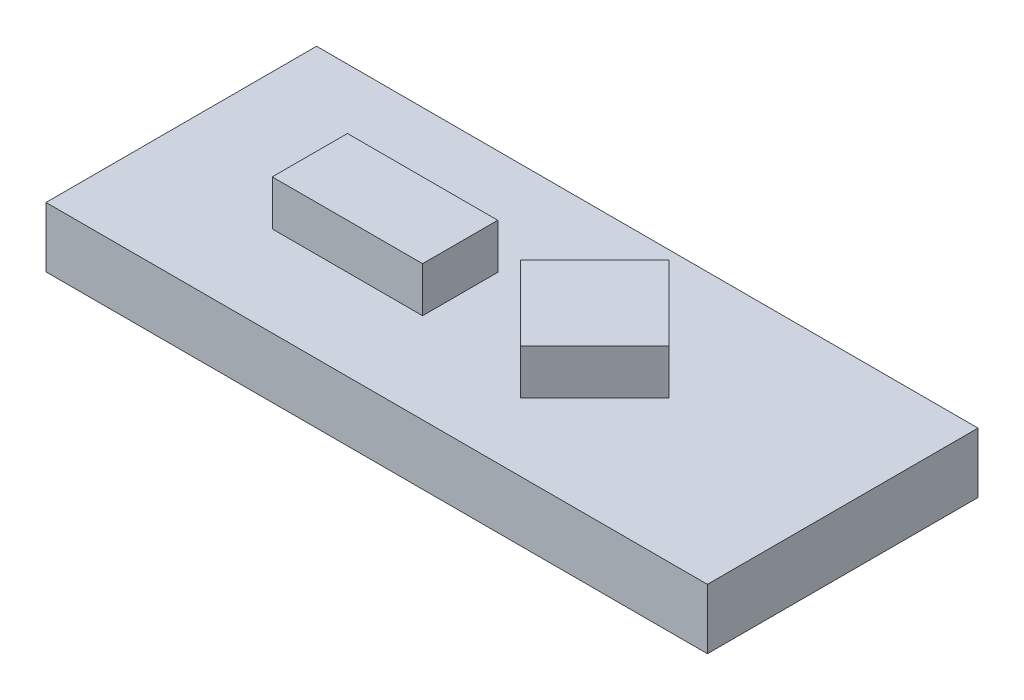
ISO-10303-21;
HEADER;
FILE_DESCRIPTION(('STEP AP214'),'2;1');
FILE_NAME('part.step','',(''),(''),'','','');
FILE_SCHEMA(('AUTOMOTIVE_DESIGN { 1 0 10303 214 1 1 1 1 }'));
ENDSEC;
DATA;
#1=APPLICATION_CONTEXT('core data for automotive mechanical design processes');
#2=APPLICATION_PROTOCOL_DEFINITION('international standard','automotive_design',2000,#1);
#3=PRODUCT_CONTEXT('',#1,'mechanical');
#4=PRODUCT('Part','Part','',(#3));
#5=PRODUCT_RELATED_PRODUCT_CATEGORY('part','',(#4));
#6=PRODUCT_DEFINITION_FORMATION('','',#4);
#7=PRODUCT_DEFINITION_CONTEXT('part definition',#1,'design');
#8=PRODUCT_DEFINITION('design','',#6,#7);
#9=PRODUCT_DEFINITION_SHAPE('','',#8);
#10=(LENGTH_UNIT() NAMED_UNIT(*) SI_UNIT(.MILLI.,.METRE.));
#11=(NAMED_UNIT(*) PLANE_ANGLE_UNIT() SI_UNIT($,.RADIAN.));
#12=(NAMED_UNIT(*) SI_UNIT($,.STERADIAN.) SOLID_ANGLE_UNIT());
#13=UNCERTAINTY_MEASURE_WITH_UNIT(LENGTH_MEASURE(1.E-05),#10,'distance_accuracy_value','');
#14=(GEOMETRIC_REPRESENTATION_CONTEXT(3) GLOBAL_UNCERTAINTY_ASSIGNED_CONTEXT((#13)) GLOBAL_UNIT_ASSIGNED_CONTEXT((#10,
#11,#12)) REPRESENTATION_CONTEXT('',''));
#15=CARTESIAN_POINT('',(0.,0.,0.));
#16=DIRECTION('',(0.,0.,1.));
#17=DIRECTION('',(1.,0.,0.));
#18=AXIS2_PLACEMENT_3D('',#15,#16,#17);
#19=CARTESIAN_POINT('',(0.,4.,0.));
#20=DIRECTION('',(0.,1.,0.));
#21=DIRECTION('',(0.,0.,1.));
#22=AXIS2_PLACEMENT_3D('',#19,#20,#21);
#23=PLANE('',#22);
#24=DIRECTION('',(1.,0.,0.));
#25=VECTOR('',#24,1.);
#26=CARTESIAN_POINT('',(-14.8736665194404,4.,-0.875576036866355));
#27=LINE('',#26,#25);
#28=CARTESIAN_POINT('',(-14.8736665194404,4.,-0.875576036866355));
#29=VERTEX_POINT('',#28);
#30=CARTESIAN_POINT('',(-4.87366651944039,4.,-0.875576036866355));
#31=VERTEX_POINT('',#30);
#32=EDGE_CURVE('E151',#29,#31,#27,.T.);
#33=ORIENTED_EDGE('',*,*,#32,.F.);
#34=DIRECTION('',(0.,0.,1.));
#35=VECTOR('',#34,1.);
#36=CARTESIAN_POINT('',(-14.8736665194404,4.,-5.87557603686635));
#37=LINE('',#36,#35);
#38=CARTESIAN_POINT('',(-14.8736665194404,4.,-5.87557603686635));
#39=VERTEX_POINT('',#38);
#40=EDGE_CURVE('E148',#39,#29,#37,.T.);
#41=ORIENTED_EDGE('',*,*,#40,.F.);
#42=DIRECTION('',(-1.,0.,0.));
#43=VECTOR('',#42,1.);
#44=CARTESIAN_POINT('',(-14.8736665194404,4.,-5.87557603686635));
#45=LINE('',#44,#43);
#46=CARTESIAN_POINT('',(-4.87366651944039,4.,-5.87557603686635));
#47=VERTEX_POINT('',#46);
#48=EDGE_CURVE('E160',#47,#39,#45,.T.);
#49=ORIENTED_EDGE('',*,*,#48,.F.);
#50=DIRECTION('',(0.,0.,-1.));
#51=VECTOR('',#50,1.);
#52=CARTESIAN_POINT('',(-4.87366651944039,4.,-5.87557603686635));
#53=LINE('',#52,#51);
#54=EDGE_CURVE('E168',#31,#47,#53,.T.);
#55=ORIENTED_EDGE('',*,*,#54,.F.);
#56=EDGE_LOOP('',(#33,#41,#49,#55));
#57=FACE_BOUND('',#56,.T.);
#58=DIRECTION('',(0.,0.,1.));
#59=VECTOR('',#58,1.);
#60=CARTESIAN_POINT('',(-23.926267281106,4.,-12.8755760368664));
#61=LINE('',#60,#59);
#62=CARTESIAN_POINT('',(-23.926267281106,4.,-12.8755760368664));
#63=VERTEX_POINT('',#62);
#64=CARTESIAN_POINT('',(-23.926267281106,4.,5.12442396313365));
#65=VERTEX_POINT('',#64);
#66=EDGE_CURVE('E180',#63,#65,#61,.T.);
#67=ORIENTED_EDGE('',*,*,#66,.T.);
#68=DIRECTION('',(1.,0.,0.));
#69=VECTOR('',#68,1.);
#70=CARTESIAN_POINT('',(-23.926267281106,4.,5.12442396313365));
#71=LINE('',#70,#69);
#72=CARTESIAN_POINT('',(20.073732718894,4.,5.12442396313365));
#73=VERTEX_POINT('',#72);
#74=EDGE_CURVE('E183',#65,#73,#71,.T.);
#75=ORIENTED_EDGE('',*,*,#74,.T.);
#76=DIRECTION('',(0.,0.,-1.));
#77=VECTOR('',#76,1.);
#78=CARTESIAN_POINT('',(20.073732718894,4.,-12.8755760368664));
#79=LINE('',#78,#77);
#80=CARTESIAN_POINT('',(20.073732718894,4.,-12.8755760368664));
#81=VERTEX_POINT('',#80);
#82=EDGE_CURVE('E186',#73,#81,#79,.T.);
#83=ORIENTED_EDGE('',*,*,#82,.T.);
#84=DIRECTION('',(-1.,0.,0.));
#85=VECTOR('',#84,1.);
#86=CARTESIAN_POINT('',(-23.926267281106,4.,-12.8755760368664));
#87=LINE('',#86,#85);
#88=EDGE_CURVE('E188',#81,#63,#87,.T.);
#89=ORIENTED_EDGE('',*,*,#88,.T.);
#90=EDGE_LOOP('',(#67,#75,#83,#89));
#91=FACE_BOUND('',#90,.T.);
#92=DIRECTION('',(0.707106781186548,0.,0.707106781186548));
#93=VECTOR('',#92,1.);
#94=CARTESIAN_POINT('',(-1.82576221771763,4.,-4.32532350517219));
#95=LINE('',#94,#93);
#96=CARTESIAN_POINT('',(-1.82576221771763,4.,-4.32532350517219));
#97=VERTEX_POINT('',#96);
#98=CARTESIAN_POINT('',(3.1239852505882,4.,0.624423963133645));
#99=VERTEX_POINT('',#98);
#100=EDGE_CURVE('E370',#97,#99,#95,.T.);
#101=ORIENTED_EDGE('',*,*,#100,.F.);
#102=DIRECTION('',(-0.707106781186548,0.,0.707106781186548));
#103=VECTOR('',#102,1.);
#104=CARTESIAN_POINT('',(-1.82576221771763,4.,-4.32532350517219));
#105=LINE('',#104,#103);
#106=CARTESIAN_POINT('',(3.1239852505882,4.,-9.27507097347802));
#107=VERTEX_POINT('',#106);
#108=EDGE_CURVE('E146',#107,#97,#105,.T.);
#109=ORIENTED_EDGE('',*,*,#108,.F.);
#110=DIRECTION('',(-0.707106781186548,0.,-0.707106781186548));
#111=VECTOR('',#110,1.);
#112=CARTESIAN_POINT('',(3.1239852505882,4.,-9.27507097347802));
#113=LINE('',#112,#111);
#114=CARTESIAN_POINT('',(8.07373271889403,4.,-4.32532350517219));
#115=VERTEX_POINT('',#114);
#116=EDGE_CURVE('E142',#115,#107,#113,.T.);
#117=ORIENTED_EDGE('',*,*,#116,.F.);
#118=DIRECTION('',(0.707106781186548,0.,-0.707106781186548));
#119=VECTOR('',#118,1.);
#120=CARTESIAN_POINT('',(3.1239852505882,4.,0.624423963133645));
#121=LINE('',#120,#119);
#122=EDGE_CURVE('E367',#99,#115,#121,.T.);
#123=ORIENTED_EDGE('',*,*,#122,.F.);
#124=EDGE_LOOP('',(#101,#109,#117,#123));
#125=FACE_BOUND('',#124,.T.);
#126=ADVANCED_FACE('F33',(#57,#91,#125),#23,.T.);
#127=CARTESIAN_POINT('',(-23.926267281106,4.,-12.8755760368664));
#128=DIRECTION('',(1.,0.,0.));
#129=DIRECTION('',(0.,0.,-1.));
#130=AXIS2_PLACEMENT_3D('',#127,#128,#129);
#131=PLANE('',#130);
#132=DIRECTION('',(0.,0.,1.));
#133=VECTOR('',#132,1.);
#134=CARTESIAN_POINT('',(-23.926267281106,0.,-12.8755760368664));
#135=LINE('',#134,#133);
#136=CARTESIAN_POINT('',(-23.926267281106,0.,-12.8755760368664));
#137=VERTEX_POINT('',#136);
#138=CARTESIAN_POINT('',(-23.926267281106,0.,5.12442396313365));
#139=VERTEX_POINT('',#138);
#140=EDGE_CURVE('E179',#137,#139,#135,.T.);
#141=ORIENTED_EDGE('',*,*,#140,.T.);
#142=DIRECTION('',(0.,-1.,0.));
#143=VECTOR('',#142,1.);
#144=CARTESIAN_POINT('',(-23.926267281106,4.,5.12442396313365));
#145=LINE('',#144,#143);
#146=EDGE_CURVE('E11',#65,#139,#145,.T.);
#147=ORIENTED_EDGE('',*,*,#146,.F.);
#148=ORIENTED_EDGE('',*,*,#66,.F.);
#149=DIRECTION('',(0.,-1.,0.));
#150=VECTOR('',#149,1.);
#151=CARTESIAN_POINT('',(-23.926267281106,4.,-12.8755760368664));
#152=LINE('',#151,#150);
#153=EDGE_CURVE('E190',#63,#137,#152,.T.);
#154=ORIENTED_EDGE('',*,*,#153,.T.);
#155=EDGE_LOOP('',(#141,#147,#148,#154));
#156=FACE_BOUND('',#155,.T.);
#157=ADVANCED_FACE('F35',(#156),#131,.F.);
#158=CARTESIAN_POINT('',(-23.926267281106,4.,5.12442396313365));
#159=DIRECTION('',(0.,0.,-1.));
#160=DIRECTION('',(-1.,0.,0.));
#161=AXIS2_PLACEMENT_3D('',#158,#159,#160);
#162=PLANE('',#161);
#163=DIRECTION('',(1.,0.,0.));
#164=VECTOR('',#163,1.);
#165=CARTESIAN_POINT('',(-23.926267281106,0.,5.12442396313365));
#166=LINE('',#165,#164);
#167=CARTESIAN_POINT('',(20.073732718894,0.,5.12442396313365));
#168=VERTEX_POINT('',#167);
#169=EDGE_CURVE('E193',#139,#168,#166,.T.);
#170=ORIENTED_EDGE('',*,*,#169,.T.);
#171=DIRECTION('',(0.,-1.,0.));
#172=VECTOR('',#171,1.);
#173=CARTESIAN_POINT('',(20.073732718894,4.,5.12442396313365));
#174=LINE('',#173,#172);
#175=EDGE_CURVE('E41',#73,#168,#174,.T.);
#176=ORIENTED_EDGE('',*,*,#175,.F.);
#177=ORIENTED_EDGE('',*,*,#74,.F.);
#178=ORIENTED_EDGE('',*,*,#146,.T.);
#179=EDGE_LOOP('',(#170,#176,#177,#178));
#180=FACE_BOUND('',#179,.T.);
#181=ADVANCED_FACE('F223',(#180),#162,.F.);
#182=CARTESIAN_POINT('',(20.073732718894,4.,-12.8755760368664));
#183=DIRECTION('',(-1.,0.,0.));
#184=DIRECTION('',(0.,0.,1.));
#185=AXIS2_PLACEMENT_3D('',#182,#183,#184);
#186=PLANE('',#185);
#187=DIRECTION('',(0.,0.,-1.));
#188=VECTOR('',#187,1.);
#189=CARTESIAN_POINT('',(20.073732718894,0.,-12.8755760368664));
#190=LINE('',#189,#188);
#191=CARTESIAN_POINT('',(20.073732718894,0.,-12.8755760368664));
#192=VERTEX_POINT('',#191);
#193=EDGE_CURVE('E195',#168,#192,#190,.T.);
#194=ORIENTED_EDGE('',*,*,#193,.T.);
#195=DIRECTION('',(0.,-1.,0.));
#196=VECTOR('',#195,1.);
#197=CARTESIAN_POINT('',(20.073732718894,4.,-12.8755760368664));
#198=LINE('',#197,#196);
#199=EDGE_CURVE('E200',#81,#192,#198,.T.);
#200=ORIENTED_EDGE('',*,*,#199,.F.);
#201=ORIENTED_EDGE('',*,*,#82,.F.);
#202=ORIENTED_EDGE('',*,*,#175,.T.);
#203=EDGE_LOOP('',(#194,#200,#201,#202));
#204=FACE_BOUND('',#203,.T.);
#205=ADVANCED_FACE('F207',(#204),#186,.F.);
#206=CARTESIAN_POINT('',(-23.926267281106,4.,-12.8755760368664));
#207=DIRECTION('',(0.,0.,1.));
#208=DIRECTION('',(1.,0.,0.));
#209=AXIS2_PLACEMENT_3D('',#206,#207,#208);
#210=PLANE('',#209);
#211=DIRECTION('',(-1.,0.,0.));
#212=VECTOR('',#211,1.);
#213=CARTESIAN_POINT('',(-23.926267281106,0.,-12.8755760368664));
#214=LINE('',#213,#212);
#215=EDGE_CURVE('E184',#192,#137,#214,.T.);
#216=ORIENTED_EDGE('',*,*,#215,.T.);
#217=ORIENTED_EDGE('',*,*,#153,.F.);
#218=ORIENTED_EDGE('',*,*,#88,.F.);
#219=ORIENTED_EDGE('',*,*,#199,.T.);
#220=EDGE_LOOP('',(#216,#217,#218,#219));
#221=FACE_BOUND('',#220,.T.);
#222=ADVANCED_FACE('F216',(#221),#210,.F.);
#223=CARTESIAN_POINT('',(0.,0.,0.));
#224=DIRECTION('',(0.,1.,0.));
#225=DIRECTION('',(0.,0.,1.));
#226=AXIS2_PLACEMENT_3D('',#223,#224,#225);
#227=PLANE('',#226);
#228=ORIENTED_EDGE('',*,*,#140,.F.);
#229=ORIENTED_EDGE('',*,*,#215,.F.);
#230=ORIENTED_EDGE('',*,*,#193,.F.);
#231=ORIENTED_EDGE('',*,*,#169,.F.);
#232=EDGE_LOOP('',(#228,#229,#230,#231));
#233=FACE_BOUND('',#232,.T.);
#234=ADVANCED_FACE('F213',(#233),#227,.F.);
#235=CARTESIAN_POINT('',(-14.8736665194404,7.,-5.87557603686635));
#236=DIRECTION('',(1.,0.,0.));
#237=DIRECTION('',(0.,0.,-1.));
#238=AXIS2_PLACEMENT_3D('',#235,#236,#237);
#239=PLANE('',#238);
#240=ORIENTED_EDGE('',*,*,#40,.T.);
#241=DIRECTION('',(0.,-1.,0.));
#242=VECTOR('',#241,1.);
#243=CARTESIAN_POINT('',(-14.8736665194404,7.,-0.875576036866355));
#244=LINE('',#243,#242);
#245=CARTESIAN_POINT('',(-14.8736665194404,7.,-0.875576036866355));
#246=VERTEX_POINT('',#245);
#247=EDGE_CURVE('E177',#246,#29,#244,.T.);
#248=ORIENTED_EDGE('',*,*,#247,.F.);
#249=DIRECTION('',(0.,0.,1.));
#250=VECTOR('',#249,1.);
#251=CARTESIAN_POINT('',(-14.8736665194404,7.,-5.87557603686635));
#252=LINE('',#251,#250);
#253=CARTESIAN_POINT('',(-14.8736665194404,7.,-5.87557603686635));
#254=VERTEX_POINT('',#253);
#255=EDGE_CURVE('E156',#254,#246,#252,.T.);
#256=ORIENTED_EDGE('',*,*,#255,.F.);
#257=DIRECTION('',(0.,-1.,0.));
#258=VECTOR('',#257,1.);
#259=CARTESIAN_POINT('',(-14.8736665194404,7.,-5.87557603686635));
#260=LINE('',#259,#258);
#261=EDGE_CURVE('E165',#254,#39,#260,.T.);
#262=ORIENTED_EDGE('',*,*,#261,.T.);
#263=EDGE_LOOP('',(#240,#248,#256,#262));
#264=FACE_BOUND('',#263,.T.);
#265=ADVANCED_FACE('F238',(#264),#239,.F.);
#266=CARTESIAN_POINT('',(-14.8736665194404,7.,-0.875576036866355));
#267=DIRECTION('',(0.,0.,-1.));
#268=DIRECTION('',(-1.,0.,0.));
#269=AXIS2_PLACEMENT_3D('',#266,#267,#268);
#270=PLANE('',#269);
#271=ORIENTED_EDGE('',*,*,#32,.T.);
#272=DIRECTION('',(0.,-1.,0.));
#273=VECTOR('',#272,1.);
#274=CARTESIAN_POINT('',(-4.87366651944039,7.,-0.875576036866355));
#275=LINE('',#274,#273);
#276=CARTESIAN_POINT('',(-4.87366651944039,7.,-0.875576036866355));
#277=VERTEX_POINT('',#276);
#278=EDGE_CURVE('E174',#277,#31,#275,.T.);
#279=ORIENTED_EDGE('',*,*,#278,.F.);
#280=DIRECTION('',(1.,0.,0.));
#281=VECTOR('',#280,1.);
#282=CARTESIAN_POINT('',(-14.8736665194404,7.,-0.875576036866355));
#283=LINE('',#282,#281);
#284=EDGE_CURVE('E159',#246,#277,#283,.T.);
#285=ORIENTED_EDGE('',*,*,#284,.F.);
#286=ORIENTED_EDGE('',*,*,#247,.T.);
#287=EDGE_LOOP('',(#271,#279,#285,#286));
#288=FACE_BOUND('',#287,.T.);
#289=ADVANCED_FACE('F257',(#288),#270,.F.);
#290=CARTESIAN_POINT('',(-4.87366651944039,7.,-5.87557603686635));
#291=DIRECTION('',(-1.,0.,0.));
#292=DIRECTION('',(0.,0.,1.));
#293=AXIS2_PLACEMENT_3D('',#290,#291,#292);
#294=PLANE('',#293);
#295=ORIENTED_EDGE('',*,*,#54,.T.);
#296=DIRECTION('',(0.,-1.,0.));
#297=VECTOR('',#296,1.);
#298=CARTESIAN_POINT('',(-4.87366651944039,7.,-5.87557603686635));
#299=LINE('',#298,#297);
#300=CARTESIAN_POINT('',(-4.87366651944039,7.,-5.87557603686635));
#301=VERTEX_POINT('',#300);
#302=EDGE_CURVE('E56',#301,#47,#299,.T.);
#303=ORIENTED_EDGE('',*,*,#302,.F.);
#304=DIRECTION('',(0.,0.,-1.));
#305=VECTOR('',#304,1.);
#306=CARTESIAN_POINT('',(-4.87366651944039,7.,-5.87557603686635));
#307=LINE('',#306,#305);
#308=EDGE_CURVE('E162',#277,#301,#307,.T.);
#309=ORIENTED_EDGE('',*,*,#308,.F.);
#310=ORIENTED_EDGE('',*,*,#278,.T.);
#311=EDGE_LOOP('',(#295,#303,#309,#310));
#312=FACE_BOUND('',#311,.T.);
#313=ADVANCED_FACE('F264',(#312),#294,.F.);
#314=CARTESIAN_POINT('',(-14.8736665194404,7.,-5.87557603686635));
#315=DIRECTION('',(0.,0.,1.));
#316=DIRECTION('',(1.,0.,0.));
#317=AXIS2_PLACEMENT_3D('',#314,#315,#316);
#318=PLANE('',#317);
#319=ORIENTED_EDGE('',*,*,#48,.T.);
#320=ORIENTED_EDGE('',*,*,#261,.F.);
#321=DIRECTION('',(-1.,0.,0.));
#322=VECTOR('',#321,1.);
#323=CARTESIAN_POINT('',(-14.8736665194404,7.,-5.87557603686635));
#324=LINE('',#323,#322);
#325=EDGE_CURVE('E164',#301,#254,#324,.T.);
#326=ORIENTED_EDGE('',*,*,#325,.F.);
#327=ORIENTED_EDGE('',*,*,#302,.T.);
#328=EDGE_LOOP('',(#319,#320,#326,#327));
#329=FACE_BOUND('',#328,.T.);
#330=ADVANCED_FACE('F271',(#329),#318,.F.);
#331=CARTESIAN_POINT('',(0.,7.,0.));
#332=DIRECTION('',(0.,1.,0.));
#333=DIRECTION('',(0.,0.,1.));
#334=AXIS2_PLACEMENT_3D('',#331,#332,#333);
#335=PLANE('',#334);
#336=ORIENTED_EDGE('',*,*,#255,.T.);
#337=ORIENTED_EDGE('',*,*,#284,.T.);
#338=ORIENTED_EDGE('',*,*,#308,.T.);
#339=ORIENTED_EDGE('',*,*,#325,.T.);
#340=EDGE_LOOP('',(#336,#337,#338,#339));
#341=FACE_BOUND('',#340,.T.);
#342=ADVANCED_FACE('F279',(#341),#335,.T.);
#343=CARTESIAN_POINT('',(-1.82576221771763,7.,-4.32532350517219));
#344=DIRECTION('',(0.707106781186547,0.,0.707106781186547));
#345=DIRECTION('',(0.707106781186548,0.,-0.707106781186548));
#346=AXIS2_PLACEMENT_3D('',#343,#344,#345);
#347=PLANE('',#346);
#348=ORIENTED_EDGE('',*,*,#108,.T.);
#349=DIRECTION('',(0.,-1.,0.));
#350=VECTOR('',#349,1.);
#351=CARTESIAN_POINT('',(-1.82576221771763,7.,-4.32532350517219));
#352=LINE('',#351,#350);
#353=CARTESIAN_POINT('',(-1.82576221771763,7.,-4.32532350517219));
#354=VERTEX_POINT('',#353);
#355=EDGE_CURVE('E127',#354,#97,#352,.T.);
#356=ORIENTED_EDGE('',*,*,#355,.F.);
#357=DIRECTION('',(-0.707106781186548,0.,0.707106781186548));
#358=VECTOR('',#357,1.);
#359=CARTESIAN_POINT('',(-1.82576221771763,7.,-4.32532350517219));
#360=LINE('',#359,#358);
#361=CARTESIAN_POINT('',(3.1239852505882,7.,-9.27507097347802));
#362=VERTEX_POINT('',#361);
#363=EDGE_CURVE('E134',#362,#354,#360,.T.);
#364=ORIENTED_EDGE('',*,*,#363,.F.);
#365=DIRECTION('',(0.,-1.,0.));
#366=VECTOR('',#365,1.);
#367=CARTESIAN_POINT('',(3.1239852505882,7.,-9.27507097347802));
#368=LINE('',#367,#366);
#369=EDGE_CURVE('E365',#362,#107,#368,.T.);
#370=ORIENTED_EDGE('',*,*,#369,.T.);
#371=EDGE_LOOP('',(#348,#356,#364,#370));
#372=FACE_BOUND('',#371,.T.);
#373=ADVANCED_FACE('F144',(#372),#347,.F.);
#374=CARTESIAN_POINT('',(-1.82576221771763,7.,-4.32532350517219));
#375=DIRECTION('',(0.707106781186547,0.,-0.707106781186547));
#376=DIRECTION('',(-0.707106781186548,0.,-0.707106781186548));
#377=AXIS2_PLACEMENT_3D('',#374,#375,#376);
#378=PLANE('',#377);
#379=ORIENTED_EDGE('',*,*,#100,.T.);
#380=DIRECTION('',(0.,-1.,0.));
#381=VECTOR('',#380,1.);
#382=CARTESIAN_POINT('',(3.1239852505882,7.,0.624423963133645));
#383=LINE('',#382,#381);
#384=CARTESIAN_POINT('',(3.1239852505882,7.,0.624423963133645));
#385=VERTEX_POINT('',#384);
#386=EDGE_CURVE('E130',#385,#99,#383,.T.);
#387=ORIENTED_EDGE('',*,*,#386,.F.);
#388=DIRECTION('',(0.707106781186548,0.,0.707106781186548));
#389=VECTOR('',#388,1.);
#390=CARTESIAN_POINT('',(-1.82576221771763,7.,-4.32532350517219));
#391=LINE('',#390,#389);
#392=EDGE_CURVE('E123',#354,#385,#391,.T.);
#393=ORIENTED_EDGE('',*,*,#392,.F.);
#394=ORIENTED_EDGE('',*,*,#355,.T.);
#395=EDGE_LOOP('',(#379,#387,#393,#394));
#396=FACE_BOUND('',#395,.T.);
#397=ADVANCED_FACE('F125',(#396),#378,.F.);
#398=CARTESIAN_POINT('',(3.1239852505882,7.,0.624423963133645));
#399=DIRECTION('',(-0.707106781186547,0.,-0.707106781186547));
#400=DIRECTION('',(-0.707106781186548,0.,0.707106781186548));
#401=AXIS2_PLACEMENT_3D('',#398,#399,#400);
#402=PLANE('',#401);
#403=ORIENTED_EDGE('',*,*,#122,.T.);
#404=DIRECTION('',(0.,-1.,0.));
#405=VECTOR('',#404,1.);
#406=CARTESIAN_POINT('',(8.07373271889403,7.,-4.32532350517219));
#407=LINE('',#406,#405);
#408=CARTESIAN_POINT('',(8.07373271889403,7.,-4.32532350517219));
#409=VERTEX_POINT('',#408);
#410=EDGE_CURVE('E48',#409,#115,#407,.T.);
#411=ORIENTED_EDGE('',*,*,#410,.F.);
#412=DIRECTION('',(0.707106781186548,0.,-0.707106781186548));
#413=VECTOR('',#412,1.);
#414=CARTESIAN_POINT('',(3.1239852505882,7.,0.624423963133645));
#415=LINE('',#414,#413);
#416=EDGE_CURVE('E133',#385,#409,#415,.T.);
#417=ORIENTED_EDGE('',*,*,#416,.F.);
#418=ORIENTED_EDGE('',*,*,#386,.T.);
#419=EDGE_LOOP('',(#403,#411,#417,#418));
#420=FACE_BOUND('',#419,.T.);
#421=ADVANCED_FACE('F299',(#420),#402,.F.);
#422=CARTESIAN_POINT('',(3.1239852505882,7.,-9.27507097347802));
#423=DIRECTION('',(-0.707106781186547,0.,0.707106781186547));
#424=DIRECTION('',(0.707106781186548,0.,0.707106781186548));
#425=AXIS2_PLACEMENT_3D('',#422,#423,#424);
#426=PLANE('',#425);
#427=ORIENTED_EDGE('',*,*,#116,.T.);
#428=ORIENTED_EDGE('',*,*,#369,.F.);
#429=DIRECTION('',(-0.707106781186548,0.,-0.707106781186548));
#430=VECTOR('',#429,1.);
#431=CARTESIAN_POINT('',(3.1239852505882,7.,-9.27507097347802));
#432=LINE('',#431,#430);
#433=EDGE_CURVE('E138',#409,#362,#432,.T.);
#434=ORIENTED_EDGE('',*,*,#433,.F.);
#435=ORIENTED_EDGE('',*,*,#410,.T.);
#436=EDGE_LOOP('',(#427,#428,#434,#435));
#437=FACE_BOUND('',#436,.T.);
#438=ADVANCED_FACE('F306',(#437),#426,.F.);
#439=CARTESIAN_POINT('',(0.,7.,0.));
#440=DIRECTION('',(0.,-1.,0.));
#441=DIRECTION('',(0.,0.,-1.));
#442=AXIS2_PLACEMENT_3D('',#439,#440,#441);
#443=PLANE('',#442);
#444=ORIENTED_EDGE('',*,*,#363,.T.);
#445=ORIENTED_EDGE('',*,*,#392,.T.);
#446=ORIENTED_EDGE('',*,*,#416,.T.);
#447=ORIENTED_EDGE('',*,*,#433,.T.);
#448=EDGE_LOOP('',(#444,#445,#446,#447));
#449=FACE_BOUND('',#448,.T.);
#450=ADVANCED_FACE('F137',(#449),#443,.F.);
#451=CLOSED_SHELL('',(#126,#157,#181,#205,#222,#234,#265,#289,#313,#330,#342,#373,#397,#421,
#438,#450));
#452=MANIFOLD_SOLID_BREP('B2',#451);
#453=ADVANCED_BREP_SHAPE_REPRESENTATION('',(#18,#452),#14);
#454=SHAPE_DEFINITION_REPRESENTATION(#9,#453);
ENDSEC;
END-ISO-10303-21;
